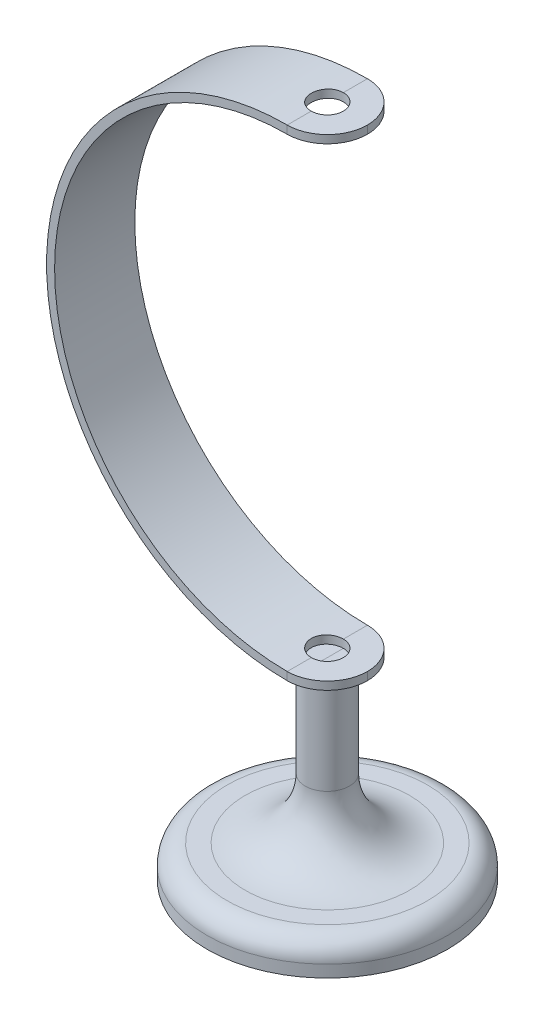
ISO-10303-21;
HEADER;
FILE_DESCRIPTION(('STEP AP214'),'2;1');
FILE_NAME('part.step','',(''),(''),'','','');
FILE_SCHEMA(('AUTOMOTIVE_DESIGN { 1 0 10303 214 1 1 1 1 }'));
ENDSEC;
DATA;
#1=APPLICATION_CONTEXT('core data for automotive mechanical design processes');
#2=APPLICATION_PROTOCOL_DEFINITION('international standard','automotive_design',2000,#1);
#3=PRODUCT_CONTEXT('',#1,'mechanical');
#4=PRODUCT('Part','Part','',(#3));
#5=PRODUCT_RELATED_PRODUCT_CATEGORY('part','',(#4));
#6=PRODUCT_DEFINITION_FORMATION('','',#4);
#7=PRODUCT_DEFINITION_CONTEXT('part definition',#1,'design');
#8=PRODUCT_DEFINITION('design','',#6,#7);
#9=PRODUCT_DEFINITION_SHAPE('','',#8);
#10=(LENGTH_UNIT() NAMED_UNIT(*) SI_UNIT(.MILLI.,.METRE.));
#11=(NAMED_UNIT(*) PLANE_ANGLE_UNIT() SI_UNIT($,.RADIAN.));
#12=(NAMED_UNIT(*) SI_UNIT($,.STERADIAN.) SOLID_ANGLE_UNIT());
#13=UNCERTAINTY_MEASURE_WITH_UNIT(LENGTH_MEASURE(1.E-05),#10,'distance_accuracy_value','');
#14=(GEOMETRIC_REPRESENTATION_CONTEXT(3) GLOBAL_UNCERTAINTY_ASSIGNED_CONTEXT((#13)) GLOBAL_UNIT_ASSIGNED_CONTEXT((#10,
#11,#12)) REPRESENTATION_CONTEXT('',''));
#15=CARTESIAN_POINT('',(0.,0.,0.));
#16=DIRECTION('',(0.,0.,1.));
#17=DIRECTION('',(1.,0.,0.));
#18=AXIS2_PLACEMENT_3D('',#15,#16,#17);
#19=CARTESIAN_POINT('',(0.,0.,10.));
#20=DIRECTION('',(0.,0.,-1.));
#21=DIRECTION('',(-1.,0.,0.));
#22=AXIS2_PLACEMENT_3D('',#19,#20,#21);
#23=CYLINDRICAL_SURFACE('',#22,60.);
#24=DIRECTION('',(0.,0.,-1.));
#25=VECTOR('',#24,1.);
#26=CARTESIAN_POINT('',(0.,60.,10.));
#27=LINE('',#26,#25);
#28=CARTESIAN_POINT('',(0.,60.,10.));
#29=VERTEX_POINT('',#28);
#30=CARTESIAN_POINT('',(0.,60.,4.));
#31=VERTEX_POINT('',#30);
#32=EDGE_CURVE('E178',#29,#31,#27,.T.);
#33=ORIENTED_EDGE('',*,*,#32,.T.);
#34=CARTESIAN_POINT('',(0.,60.,4.));
#35=CARTESIAN_POINT('',(-0.112371032710319,60.0000030634327,4.00001092268718));
#36=CARTESIAN_POINT('',(-0.22473678577279,59.9996843829148,3.99526483089793));
#37=CARTESIAN_POINT('',(-0.448661950342467,59.9984261611816,3.97634317154974));
#38=CARTESIAN_POINT('',(-0.560221406683238,59.9974866547597,3.96216813242241));
#39=CARTESIAN_POINT('',(-0.781663063848554,59.9950103866734,3.92448807132823));
#40=CARTESIAN_POINT('',(-0.891546525483028,59.9934740995825,3.90099046256448));
#41=CARTESIAN_POINT('',(-1.10891204799116,59.989850431352,3.84485781218503));
#42=CARTESIAN_POINT('',(-1.21639413387625,59.9877630559551,3.81222286578685));
#43=CARTESIAN_POINT('',(-1.53419075732481,59.9807549057059,3.70088329524817));
#44=CARTESIAN_POINT('',(-1.739958315075,59.9750868794872,3.60872637429064));
#45=CARTESIAN_POINT('',(-2.1329549311456,59.9623991004775,3.39131240873589));
#46=CARTESIAN_POINT('',(-2.32018700090438,59.9553795678116,3.26606075317259));
#47=CARTESIAN_POINT('',(-2.67127986114069,59.9407640677589,2.98575966756193));
#48=CARTESIAN_POINT('',(-2.83510755957886,59.9331673069989,2.83066875962486));
#49=CARTESIAN_POINT('',(-3.13443791962852,59.9182595797856,2.49516702233937));
#50=CARTESIAN_POINT('',(-3.26993626363705,59.9109486570339,2.31475234045352));
#51=CARTESIAN_POINT('',(-3.50885688423206,59.8974315321756,1.93353713771199));
#52=CARTESIAN_POINT('',(-3.61225029528998,59.8912263263418,1.73271848568472));
#53=CARTESIAN_POINT('',(-3.78383275171654,59.8806316188464,1.31653643347671));
#54=CARTESIAN_POINT('',(-3.85202437272642,59.8762419843479,1.101174098731));
#55=CARTESIAN_POINT('',(-3.95118014022177,59.8697809110163,0.662344951774969));
#56=CARTESIAN_POINT('',(-3.98219930104074,59.867706046695,0.438890621749774));
#57=CARTESIAN_POINT('',(-4.0062993587453,59.8660982411822,-0.0100676249487472));
#58=CARTESIAN_POINT('',(-3.99937980042443,59.8665653304903,-0.235571566181856));
#59=CARTESIAN_POINT('',(-3.94784337127258,59.86998566339,-0.681840002059499));
#60=CARTESIAN_POINT('',(-3.90328719351814,59.8729349042188,-0.902611540818756));
#61=CARTESIAN_POINT('',(-3.77783592004167,59.880980888863,-1.33353418661869));
#62=CARTESIAN_POINT('',(-3.69694074833035,59.886077637169,-1.54368527144966));
#63=CARTESIAN_POINT('',(-3.50103982391652,59.8978489791101,-1.94760041197276));
#64=CARTESIAN_POINT('',(-3.38600588779343,59.9045248754907,-2.14135075743365));
#65=CARTESIAN_POINT('',(-3.12510907508096,59.9187006779185,-2.5068082266178));
#66=CARTESIAN_POINT('',(-2.97924725025485,59.9262005558495,-2.67851610204869));
#67=CARTESIAN_POINT('',(-2.66055291986844,59.9411955701676,-2.99534099193144));
#68=CARTESIAN_POINT('',(-2.48767182301086,59.9486906730973,-3.14040905479783));
#69=CARTESIAN_POINT('',(-2.11980880311531,59.9628230450929,-3.39955441891251));
#70=CARTESIAN_POINT('',(-1.92482001827281,59.9694600464449,-3.51362206069822));
#71=CARTESIAN_POINT('',(-1.62016719837682,59.9782084304312,-3.65893408385144));
#72=CARTESIAN_POINT('',(-1.51649247547567,59.9809252087491,-3.70310035197746));
#73=CARTESIAN_POINT('',(-1.3057891076548,59.9858815616623,-3.78253433606169));
#74=CARTESIAN_POINT('',(-1.1987617446156,59.9881213161534,-3.81780540751401));
#75=CARTESIAN_POINT('',(-0.982232697003488,59.9920573105263,-3.87915913980449));
#76=CARTESIAN_POINT('',(-0.872733845135397,59.9937541418758,-3.90525180282242));
#77=CARTESIAN_POINT('',(-0.65196127842849,59.996559237123,-3.94811083929204));
#78=CARTESIAN_POINT('',(-0.540688458908,59.9976677888072,-3.96488177312304));
#79=CARTESIAN_POINT('',(-0.35764928763552,59.9989764272939,-3.98462412788323));
#80=CARTESIAN_POINT('',(-0.286174065634232,59.9993601371831,-3.99039367817954));
#81=CARTESIAN_POINT('',(-0.143135053144747,59.999871917267,-3.99807887239426));
#82=CARTESIAN_POINT('',(-0.0715716076054835,60.0000004115216,-4.00000090928398));
#83=CARTESIAN_POINT('',(0.,60.,-4.));
#84=B_SPLINE_CURVE_WITH_KNOTS('',3,(#34,#35,#36,#37,#38,#39,#40,#41,#42,#43,#44,#45,#46,#47,#48,
#49,#50,#51,#52,#53,#54,#55,#56,#57,#58,#59,#60,#61,#62,#63,#64,#65,#66,#67,#68,#69,#70,#71,#72,
#73,#74,#75,#76,#77,#78,#79,#80,#81,#82,#83),.UNSPECIFIED.,.F.,.F.,(4,2,2,2,2,2,2,2,2,2,2,2,2,2,
2,2,2,2,2,2,2,2,2,2,4),(0.,0.337002972550628,0.673987059851585,1.01070371653524,
1.34741686452381,2.02053463523423,2.69354286521535,3.36749345524478,4.04154668557006,
4.71620421363562,5.39081237142408,6.06442088769803,6.73803748625929,7.41056987520693,
8.08310367050908,8.75619423115692,9.42926183150128,10.1035541045893,10.7780562410451,
11.1158956626445,11.4536074513665,11.7909500698234,12.1281275078318,12.3431577851045,
12.5578304736941),.UNSPECIFIED.);
#85=CARTESIAN_POINT('',(0.,60.,-4.));
#86=VERTEX_POINT('',#85);
#87=EDGE_CURVE('E220',#31,#86,#84,.T.);
#88=ORIENTED_EDGE('',*,*,#87,.T.);
#89=CARTESIAN_POINT('',(0.,60.,-10.));
#90=VERTEX_POINT('',#89);
#91=EDGE_CURVE('E180',#86,#90,#27,.T.);
#92=ORIENTED_EDGE('',*,*,#91,.T.);
#93=CARTESIAN_POINT('',(0.,0.,-10.));
#94=DIRECTION('',(0.,0.,1.));
#95=DIRECTION('',(1.,0.,0.));
#96=AXIS2_PLACEMENT_3D('',#93,#94,#95);
#97=CIRCLE('',#96,60.);
#98=CARTESIAN_POINT('',(0.,-60.,-10.));
#99=VERTEX_POINT('',#98);
#100=EDGE_CURVE('E185',#90,#99,#97,.T.);
#101=ORIENTED_EDGE('',*,*,#100,.T.);
#102=DIRECTION('',(0.,0.,-1.));
#103=VECTOR('',#102,1.);
#104=CARTESIAN_POINT('',(0.,-60.,10.));
#105=LINE('',#104,#103);
#106=CARTESIAN_POINT('',(0.,-60.,-5.5));
#107=VERTEX_POINT('',#106);
#108=EDGE_CURVE('E159',#107,#99,#105,.T.);
#109=ORIENTED_EDGE('',*,*,#108,.F.);
#110=CARTESIAN_POINT('',(0.,-60.,-4.));
#111=VERTEX_POINT('',#110);
#112=EDGE_CURVE('E139',#111,#107,#105,.T.);
#113=ORIENTED_EDGE('',*,*,#112,.F.);
#114=CARTESIAN_POINT('',(0.,-60.,-4.));
#115=CARTESIAN_POINT('',(-0.112371032710305,-60.0000030634327,-4.00001092268718));
#116=CARTESIAN_POINT('',(-0.224736785772775,-59.9996843829148,-3.99526483089793));
#117=CARTESIAN_POINT('',(-0.448661950342452,-59.9984261611816,-3.97634317154974));
#118=CARTESIAN_POINT('',(-0.560221406683223,-59.9974866547597,-3.96216813242241));
#119=CARTESIAN_POINT('',(-0.78166306384854,-59.9950103866734,-3.92448807132824));
#120=CARTESIAN_POINT('',(-0.891546525483014,-59.9934740995825,-3.90099046256448));
#121=CARTESIAN_POINT('',(-1.10891204799115,-59.989850431352,-3.84485781218504));
#122=CARTESIAN_POINT('',(-1.21639413387624,-59.9877630559551,-3.81222286578686));
#123=CARTESIAN_POINT('',(-1.53419075732479,-59.9807549057059,-3.70088329524817));
#124=CARTESIAN_POINT('',(-1.73995831507498,-59.9750868794872,-3.60872637429064));
#125=CARTESIAN_POINT('',(-2.13295493114558,-59.9623991004775,-3.3913124087359));
#126=CARTESIAN_POINT('',(-2.32018700090436,-59.9553795678116,-3.2660607531726));
#127=CARTESIAN_POINT('',(-2.67127986114068,-59.9407640677589,-2.98575966756194));
#128=CARTESIAN_POINT('',(-2.83510755957885,-59.9331673069989,-2.83066875962487));
#129=CARTESIAN_POINT('',(-3.13443791962851,-59.9182595797856,-2.49516702233939));
#130=CARTESIAN_POINT('',(-3.26993626363704,-59.9109486570339,-2.31475234045353));
#131=CARTESIAN_POINT('',(-3.50885688423206,-59.8974315321756,-1.93353713771201));
#132=CARTESIAN_POINT('',(-3.61225029528997,-59.8912263263418,-1.73271848568474));
#133=CARTESIAN_POINT('',(-3.78383275171654,-59.8806316188464,-1.31653643347672));
#134=CARTESIAN_POINT('',(-3.85202437272642,-59.8762419843479,-1.10117409873101));
#135=CARTESIAN_POINT('',(-3.95118014022177,-59.8697809110163,-0.662344951774984));
#136=CARTESIAN_POINT('',(-3.98219930104073,-59.867706046695,-0.438890621749789));
#137=CARTESIAN_POINT('',(-4.0062993587453,-59.8660982411822,0.0100676249487316));
#138=CARTESIAN_POINT('',(-3.99937980042443,-59.8665653304903,0.235571566181841));
#139=CARTESIAN_POINT('',(-3.94784337127258,-59.86998566339,0.681840002059484));
#140=CARTESIAN_POINT('',(-3.90328719351814,-59.8729349042188,0.902611540818741));
#141=CARTESIAN_POINT('',(-3.77783592004168,-59.880980888863,1.33353418661867));
#142=CARTESIAN_POINT('',(-3.69694074833035,-59.886077637169,1.54368527144965));
#143=CARTESIAN_POINT('',(-3.50103982391652,-59.8978489791101,1.94760041197274));
#144=CARTESIAN_POINT('',(-3.38600588779344,-59.9045248754907,2.14135075743364));
#145=CARTESIAN_POINT('',(-3.12510907508097,-59.9187006779185,2.50680822661779));
#146=CARTESIAN_POINT('',(-2.97924725025486,-59.9262005558495,2.67851610204868));
#147=CARTESIAN_POINT('',(-2.66055291986845,-59.9411955701676,2.99534099193143));
#148=CARTESIAN_POINT('',(-2.48767182301087,-59.9486906730973,3.14040905479782));
#149=CARTESIAN_POINT('',(-2.11980880311532,-59.9628230450929,3.39955441891251));
#150=CARTESIAN_POINT('',(-1.92482001827283,-59.9694600464449,3.51362206069821));
#151=CARTESIAN_POINT('',(-1.62016719837684,-59.9782084304312,3.65893408385143));
#152=CARTESIAN_POINT('',(-1.51649247547568,-59.9809252087491,3.70310035197745));
#153=CARTESIAN_POINT('',(-1.30578910765482,-59.9858815616623,3.78253433606169));
#154=CARTESIAN_POINT('',(-1.19876174461561,-59.9881213161534,3.817805407514));
#155=CARTESIAN_POINT('',(-0.982232697003501,-59.9920573105263,3.87915913980449));
#156=CARTESIAN_POINT('',(-0.872733845135411,-59.9937541418758,3.90525180282242));
#157=CARTESIAN_POINT('',(-0.651961278428503,-59.996559237123,3.94811083929204));
#158=CARTESIAN_POINT('',(-0.540688458908014,-59.9976677888072,3.96488177312304));
#159=CARTESIAN_POINT('',(-0.357649287635531,-59.9989764272939,3.98462412788323));
#160=CARTESIAN_POINT('',(-0.286174065634239,-59.9993601371831,3.99039367817954));
#161=CARTESIAN_POINT('',(-0.143135053144748,-59.999871917267,3.99807887239426));
#162=CARTESIAN_POINT('',(-0.0715716076054825,-60.0000004115216,4.00000090928398));
#163=CARTESIAN_POINT('',(0.,-60.,4.));
#164=B_SPLINE_CURVE_WITH_KNOTS('',3,(#114,#115,#116,#117,#118,#119,#120,#121,#122,#123,#124,
#125,#126,#127,#128,#129,#130,#131,#132,#133,#134,#135,#136,#137,#138,#139,#140,#141,#142,#143,
#144,#145,#146,#147,#148,#149,#150,#151,#152,#153,#154,#155,#156,#157,#158,#159,#160,#161,#162,
#163),.UNSPECIFIED.,.F.,.F.,(4,2,2,2,2,2,2,2,2,2,2,2,2,2,2,2,2,2,2,2,2,2,2,2,4),(0.,
0.337002972550627,0.673987059851585,1.01070371653523,1.34741686452381,2.02053463523423,
2.69354286521535,3.36749345524478,4.04154668557006,4.71620421363562,5.39081237142408,
6.06442088769803,6.73803748625929,7.41056987520693,8.08310367050908,8.75619423115692,
9.42926183150128,10.1035541045893,10.7780562410451,11.1158956626445,11.4536074513665,
11.7909500698234,12.1281275078318,12.3431577851045,12.5578304736941),.UNSPECIFIED.);
#165=CARTESIAN_POINT('',(0.,-60.,4.));
#166=VERTEX_POINT('',#165);
#167=EDGE_CURVE('E150',#111,#166,#164,.T.);
#168=ORIENTED_EDGE('',*,*,#167,.T.);
#169=DIRECTION('',(0.,0.,-1.));
#170=VECTOR('',#169,1.);
#171=CARTESIAN_POINT('',(0.,-60.,10.));
#172=LINE('',#171,#170);
#173=CARTESIAN_POINT('',(0.,-60.,5.5));
#174=VERTEX_POINT('',#173);
#175=EDGE_CURVE('E136',#166,#174,#172,.F.);
#176=ORIENTED_EDGE('',*,*,#175,.T.);
#177=CARTESIAN_POINT('',(0.,-60.,10.));
#178=VERTEX_POINT('',#177);
#179=EDGE_CURVE('E147',#178,#174,#105,.T.);
#180=ORIENTED_EDGE('',*,*,#179,.F.);
#181=CARTESIAN_POINT('',(0.,0.,10.));
#182=DIRECTION('',(0.,0.,1.));
#183=DIRECTION('',(1.,0.,0.));
#184=AXIS2_PLACEMENT_3D('',#181,#182,#183);
#185=CIRCLE('',#184,60.);
#186=EDGE_CURVE('E184',#29,#178,#185,.T.);
#187=ORIENTED_EDGE('',*,*,#186,.F.);
#188=EDGE_LOOP('',(#33,#88,#92,#101,#109,#113,#168,#176,#180,#187));
#189=FACE_BOUND('',#188,.T.);
#190=ADVANCED_FACE('F37',(#189),#23,.T.);
#191=CARTESIAN_POINT('',(0.,-60.,10.));
#192=DIRECTION('',(0.,1.,0.));
#193=DIRECTION('',(0.,0.,1.));
#194=AXIS2_PLACEMENT_3D('',#191,#192,#193);
#195=PLANE('',#194);
#196=ORIENTED_EDGE('',*,*,#179,.T.);
#197=CARTESIAN_POINT('',(0.,-60.,0.));
#198=DIRECTION('',(0.,1.,0.));
#199=DIRECTION('',(0.,0.,1.));
#200=AXIS2_PLACEMENT_3D('',#197,#198,#199);
#201=CIRCLE('',#200,5.5);
#202=EDGE_CURVE('E121',#174,#107,#201,.T.);
#203=ORIENTED_EDGE('',*,*,#202,.T.);
#204=ORIENTED_EDGE('',*,*,#108,.T.);
#205=CARTESIAN_POINT('',(0.,-60.,0.));
#206=DIRECTION('',(0.,1.,0.));
#207=DIRECTION('',(0.,0.,1.));
#208=AXIS2_PLACEMENT_3D('',#205,#206,#207);
#209=CIRCLE('',#208,10.);
#210=CARTESIAN_POINT('',(10.,-60.,0.));
#211=VERTEX_POINT('',#210);
#212=EDGE_CURVE('E493',#99,#211,#209,.F.);
#213=ORIENTED_EDGE('',*,*,#212,.T.);
#214=CARTESIAN_POINT('',(0.,-60.,0.));
#215=DIRECTION('',(0.,1.,0.));
#216=DIRECTION('',(0.,0.,1.));
#217=AXIS2_PLACEMENT_3D('',#214,#215,#216);
#218=CIRCLE('',#217,10.);
#219=EDGE_CURVE('E155',#211,#178,#218,.F.);
#220=ORIENTED_EDGE('',*,*,#219,.T.);
#221=EDGE_LOOP('',(#196,#203,#204,#213,#220));
#222=FACE_BOUND('',#221,.T.);
#223=ADVANCED_FACE('F153',(#222),#195,.F.);
#224=CARTESIAN_POINT('',(0.,-58.,10.));
#225=DIRECTION('',(0.,-1.,0.));
#226=DIRECTION('',(0.,0.,-1.));
#227=AXIS2_PLACEMENT_3D('',#224,#225,#226);
#228=PLANE('',#227);
#229=CARTESIAN_POINT('',(0.,-58.,0.));
#230=DIRECTION('',(0.,-1.,0.));
#231=DIRECTION('',(0.,0.,-1.));
#232=AXIS2_PLACEMENT_3D('',#229,#230,#231);
#233=CIRCLE('',#232,10.);
#234=CARTESIAN_POINT('',(0.,-58.,10.));
#235=VERTEX_POINT('',#234);
#236=CARTESIAN_POINT('',(10.,-58.,0.));
#237=VERTEX_POINT('',#236);
#238=EDGE_CURVE('E161',#235,#237,#233,.F.);
#239=ORIENTED_EDGE('',*,*,#238,.T.);
#240=CARTESIAN_POINT('',(0.,-58.,0.));
#241=DIRECTION('',(0.,-1.,0.));
#242=DIRECTION('',(0.,0.,-1.));
#243=AXIS2_PLACEMENT_3D('',#240,#241,#242);
#244=CIRCLE('',#243,10.);
#245=CARTESIAN_POINT('',(0.,-58.,-10.));
#246=VERTEX_POINT('',#245);
#247=EDGE_CURVE('E492',#237,#246,#244,.F.);
#248=ORIENTED_EDGE('',*,*,#247,.T.);
#249=DIRECTION('',(0.,0.,-1.));
#250=VECTOR('',#249,1.);
#251=CARTESIAN_POINT('',(0.,-58.,10.));
#252=LINE('',#251,#250);
#253=CARTESIAN_POINT('',(0.,-58.,-4.));
#254=VERTEX_POINT('',#253);
#255=EDGE_CURVE('E167',#254,#246,#252,.T.);
#256=ORIENTED_EDGE('',*,*,#255,.F.);
#257=CARTESIAN_POINT('',(0.,-58.,0.));
#258=DIRECTION('',(0.,-1.,0.));
#259=DIRECTION('',(0.,0.,-1.));
#260=AXIS2_PLACEMENT_3D('',#257,#258,#259);
#261=CIRCLE('',#260,4.);
#262=CARTESIAN_POINT('',(0.,-58.,4.));
#263=VERTEX_POINT('',#262);
#264=EDGE_CURVE('E199',#254,#263,#261,.T.);
#265=ORIENTED_EDGE('',*,*,#264,.T.);
#266=EDGE_CURVE('E164',#235,#263,#252,.T.);
#267=ORIENTED_EDGE('',*,*,#266,.F.);
#268=EDGE_LOOP('',(#239,#248,#256,#265,#267));
#269=FACE_BOUND('',#268,.T.);
#270=ADVANCED_FACE('F247',(#269),#228,.F.);
#271=CARTESIAN_POINT('',(0.,0.,10.));
#272=DIRECTION('',(0.,0.,-1.));
#273=DIRECTION('',(-1.,0.,0.));
#274=AXIS2_PLACEMENT_3D('',#271,#272,#273);
#275=CYLINDRICAL_SURFACE('',#274,58.);
#276=DIRECTION('',(0.,0.,-1.));
#277=VECTOR('',#276,1.);
#278=CARTESIAN_POINT('',(0.,58.,10.));
#279=LINE('',#278,#277);
#280=CARTESIAN_POINT('',(0.,58.,-4.));
#281=VERTEX_POINT('',#280);
#282=CARTESIAN_POINT('',(0.,58.,-10.));
#283=VERTEX_POINT('',#282);
#284=EDGE_CURVE('E177',#281,#283,#279,.T.);
#285=ORIENTED_EDGE('',*,*,#284,.F.);
#286=CARTESIAN_POINT('',(0.,58.,-4.));
#287=CARTESIAN_POINT('',(-0.11236175422204,58.0000031682024,-4.00001093280938));
#288=CARTESIAN_POINT('',(-0.224718217128175,57.9996735535033,-3.99526561361154));
#289=CARTESIAN_POINT('',(-0.448624697841071,57.998372159905,-3.97634710411243));
#290=CARTESIAN_POINT('',(-0.560174760939207,57.9974004173586,-3.96217444752137));
#291=CARTESIAN_POINT('',(-0.781596881345706,57.9948391895657,-3.92450095270218));
#292=CARTESIAN_POINT('',(-0.891470209584035,57.993250199101,-3.90100758557461));
#293=CARTESIAN_POINT('',(-1.10881554671644,57.9895022121644,-3.84488531923452));
#294=CARTESIAN_POINT('',(-1.21628758033138,57.9873432215634,-3.8122565141164));
#295=CARTESIAN_POINT('',(-1.53405377947638,57.9800946211758,-3.70093861853809));
#296=CARTESIAN_POINT('',(-1.73980130636269,57.9742321057639,-3.60880037942061));
#297=CARTESIAN_POINT('',(-2.13276194647164,57.9611087272199,-3.39143203312992));
#298=CARTESIAN_POINT('',(-2.31997802722113,57.953848088526,-3.26620723608433));
#299=CARTESIAN_POINT('',(-2.6710629474354,57.9387293705922,-2.98595319092372));
#300=CARTESIAN_POINT('',(-2.83489642905136,57.9308704135565,-2.83087962159238));
#301=CARTESIAN_POINT('',(-3.13424265345783,57.9154475194713,-2.49541164142013));
#302=CARTESIAN_POINT('',(-3.26975107888627,57.9078836275389,-2.31501337753284));
#303=CARTESIAN_POINT('',(-3.50870453840358,57.8938976176425,-1.93381463520119));
#304=CARTESIAN_POINT('',(-3.61211856323652,57.8874766064555,-1.73299467266007));
#305=CARTESIAN_POINT('',(-3.78374068059917,57.8765128985977,-1.31680303303012));
#306=CARTESIAN_POINT('',(-3.85195137186097,57.8719700632837,-1.10143243140634));
#307=CARTESIAN_POINT('',(-3.95113619069501,57.8652833360189,-0.662604025107607));
#308=CARTESIAN_POINT('',(-3.98216923355732,57.8631356488593,-0.439159595509882));
#309=CARTESIAN_POINT('',(-4.00629963168883,57.8614700548312,0.00978191912161445));
#310=CARTESIAN_POINT('',(-3.99939656115485,57.8619521774802,0.235279027166733));
#311=CARTESIAN_POINT('',(-3.9478984256541,57.8654883992797,0.681510227435335));
#312=CARTESIAN_POINT('',(-3.90336830425722,57.8685380668639,0.902251854757237));
#313=CARTESIAN_POINT('',(-3.77798033584864,57.8768587449812,1.33311904716117));
#314=CARTESIAN_POINT('',(-3.6971223996201,57.8821297609697,1.54324458616992));
#315=CARTESIAN_POINT('',(-3.50130137577978,57.8943043483875,1.94712719872821));
#316=CARTESIAN_POINT('',(-3.38630821512077,57.9012093582688,2.14086964461991));
#317=CARTESIAN_POINT('',(-3.12549855944105,57.9158721651976,2.50632010097095));
#318=CARTESIAN_POINT('',(-2.979683083369,57.9236299340498,2.67802883953665));
#319=CARTESIAN_POINT('',(-2.66106195167062,57.9391423245419,2.99488890762832));
#320=CARTESIAN_POINT('',(-2.48820403312607,57.9468969103096,3.13998760504947));
#321=CARTESIAN_POINT('',(-2.12038007456978,57.9615193174616,3.39919831369613));
#322=CARTESIAN_POINT('',(-1.92540718047545,57.9683868625078,3.51330068084253));
#323=CARTESIAN_POINT('',(-1.62077081854989,57.9774398343909,3.65866683906783));
#324=CARTESIAN_POINT('',(-1.51710007660152,57.980251340629,3.70285158867142));
#325=CARTESIAN_POINT('',(-1.30640229889772,57.9853807852697,3.78232271476375));
#326=CARTESIAN_POINT('',(-1.19937654633164,57.9876989097959,3.81761244774321));
#327=CARTESIAN_POINT('',(-0.98284831729815,57.9917729578114,3.87900334373393));
#328=CARTESIAN_POINT('',(-0.873348674526821,57.9935294927661,3.90511450358788));
#329=CARTESIAN_POINT('',(-0.652572389128576,57.9964337149082,3.94801002846066));
#330=CARTESIAN_POINT('',(-0.541296642615294,57.9975816997169,3.96479895286167));
#331=CARTESIAN_POINT('',(-0.358154011001368,57.9989381388956,3.98458061678791));
#332=CARTESIAN_POINT('',(-0.28657828447771,57.9993362007817,3.99036648869507));
#333=CARTESIAN_POINT('',(-0.143337530879748,57.9998671256579,3.99807343424415));
#334=CARTESIAN_POINT('',(-0.071672850458434,58.0000004287328,4.0000009213766));
#335=CARTESIAN_POINT('',(0.,58.,4.));
#336=B_SPLINE_CURVE_WITH_KNOTS('',3,(#286,#287,#288,#289,#290,#291,#292,#293,#294,#295,#296,
#297,#298,#299,#300,#301,#302,#303,#304,#305,#306,#307,#308,#309,#310,#311,#312,#313,#314,#315,
#316,#317,#318,#319,#320,#321,#322,#323,#324,#325,#326,#327,#328,#329,#330,#331,#332,#333,#334,
#335),.UNSPECIFIED.,.F.,.F.,(4,2,2,2,2,2,2,2,2,2,2,2,2,2,2,2,2,2,2,2,2,2,2,2,4),(0.,
0.33697511168641,0.673931147811789,1.01061763767491,1.34730065981684,2.02035634855754,
2.69330408279457,3.36725886725825,4.04131630248043,4.71602299146935,5.39067986606235,
6.06426619401801,6.73786008246846,7.4102937299492,8.08272902885723,8.75575850872605,
9.42876574252874,10.1030900919431,10.7776240083681,11.1154810495627,11.4532104105617,
11.790570785543,12.1277660163597,12.3431005323963,12.5580768165367),.UNSPECIFIED.);
#337=CARTESIAN_POINT('',(0.,58.,4.));
#338=VERTEX_POINT('',#337);
#339=EDGE_CURVE('E230',#281,#338,#336,.T.);
#340=ORIENTED_EDGE('',*,*,#339,.T.);
#341=CARTESIAN_POINT('',(0.,58.,10.));
#342=VERTEX_POINT('',#341);
#343=EDGE_CURVE('E173',#342,#338,#279,.T.);
#344=ORIENTED_EDGE('',*,*,#343,.F.);
#345=CARTESIAN_POINT('',(0.,0.,10.));
#346=DIRECTION('',(0.,0.,-1.));
#347=DIRECTION('',(1.,0.,0.));
#348=AXIS2_PLACEMENT_3D('',#345,#346,#347);
#349=CIRCLE('',#348,58.);
#350=EDGE_CURVE('E188',#235,#342,#349,.T.);
#351=ORIENTED_EDGE('',*,*,#350,.F.);
#352=ORIENTED_EDGE('',*,*,#266,.T.);
#353=CARTESIAN_POINT('',(0.,-58.,4.));
#354=CARTESIAN_POINT('',(-0.112361754222025,-58.0000031682024,4.00001093280938));
#355=CARTESIAN_POINT('',(-0.224718217128161,-57.9996735535033,3.99526561361154));
#356=CARTESIAN_POINT('',(-0.448624697841058,-57.998372159905,3.97634710411243));
#357=CARTESIAN_POINT('',(-0.560174760939194,-57.9974004173586,3.96217444752137));
#358=CARTESIAN_POINT('',(-0.781596881345693,-57.9948391895657,3.92450095270218));
#359=CARTESIAN_POINT('',(-0.891470209584021,-57.993250199101,3.90100758557461));
#360=CARTESIAN_POINT('',(-1.10881554671643,-57.9895022121644,3.84488531923452));
#361=CARTESIAN_POINT('',(-1.21628758033137,-57.9873432215634,3.81225651411641));
#362=CARTESIAN_POINT('',(-1.53405377947636,-57.9800946211758,3.7009386185381));
#363=CARTESIAN_POINT('',(-1.73980130636268,-57.9742321057639,3.60880037942061));
#364=CARTESIAN_POINT('',(-2.13276194647163,-57.9611087272199,3.39143203312993));
#365=CARTESIAN_POINT('',(-2.31997802722112,-57.953848088526,3.26620723608434));
#366=CARTESIAN_POINT('',(-2.67106294743539,-57.9387293705922,2.98595319092372));
#367=CARTESIAN_POINT('',(-2.83489642905135,-57.9308704135565,2.83087962159239));
#368=CARTESIAN_POINT('',(-3.13424265345782,-57.9154475194713,2.49541164142014));
#369=CARTESIAN_POINT('',(-3.26975107888626,-57.9078836275389,2.31501337753285));
#370=CARTESIAN_POINT('',(-3.50870453840358,-57.8938976176425,1.9338146352012));
#371=CARTESIAN_POINT('',(-3.61211856323651,-57.8874766064555,1.73299467266008));
#372=CARTESIAN_POINT('',(-3.78374068059917,-57.8765128985977,1.31680303303014));
#373=CARTESIAN_POINT('',(-3.85195137186096,-57.8719700632837,1.10143243140635));
#374=CARTESIAN_POINT('',(-3.95113619069501,-57.8652833360189,0.662604025107619));
#375=CARTESIAN_POINT('',(-3.98216923355732,-57.8631356488593,0.439159595509894));
#376=CARTESIAN_POINT('',(-4.00629963168883,-57.8614700548312,-0.00978191912160201));
#377=CARTESIAN_POINT('',(-3.99939656115485,-57.8619521774802,-0.235279027166721));
#378=CARTESIAN_POINT('',(-3.9478984256541,-57.8654883992797,-0.681510227435322));
#379=CARTESIAN_POINT('',(-3.90336830425722,-57.8685380668639,-0.902251854757224));
#380=CARTESIAN_POINT('',(-3.77798033584865,-57.8768587449812,-1.33311904716116));
#381=CARTESIAN_POINT('',(-3.6971223996201,-57.8821297609697,-1.54324458616991));
#382=CARTESIAN_POINT('',(-3.50130137577978,-57.8943043483875,-1.9471271987282));
#383=CARTESIAN_POINT('',(-3.38630821512078,-57.9012093582688,-2.1408696446199));
#384=CARTESIAN_POINT('',(-3.12549855944106,-57.9158721651976,-2.50632010097094));
#385=CARTESIAN_POINT('',(-2.97968308336901,-57.9236299340498,-2.67802883953664));
#386=CARTESIAN_POINT('',(-2.66106195167063,-57.9391423245419,-2.99488890762831));
#387=CARTESIAN_POINT('',(-2.48820403312608,-57.9468969103096,-3.13998760504946));
#388=CARTESIAN_POINT('',(-2.12038007456979,-57.9615193174616,-3.39919831369612));
#389=CARTESIAN_POINT('',(-1.92540718047546,-57.9683868625078,-3.51330068084252));
#390=CARTESIAN_POINT('',(-1.6207708185499,-57.9774398343909,-3.65866683906783));
#391=CARTESIAN_POINT('',(-1.51710007660153,-57.980251340629,-3.70285158867142));
#392=CARTESIAN_POINT('',(-1.30640229889773,-57.9853807852697,-3.78232271476375));
#393=CARTESIAN_POINT('',(-1.19937654633165,-57.9876989097959,-3.81761244774321));
#394=CARTESIAN_POINT('',(-0.982848317298161,-57.9917729578114,-3.87900334373392));
#395=CARTESIAN_POINT('',(-0.873348674526833,-57.9935294927661,-3.90511450358788));
#396=CARTESIAN_POINT('',(-0.652572389128587,-57.9964337149082,-3.94801002846066));
#397=CARTESIAN_POINT('',(-0.541296642615306,-57.9975816997169,-3.96479895286167));
#398=CARTESIAN_POINT('',(-0.358154011001376,-57.9989381388956,-3.98458061678791));
#399=CARTESIAN_POINT('',(-0.286578284477714,-57.9993362007817,-3.99036648869507));
#400=CARTESIAN_POINT('',(-0.143337530879743,-57.9998671256579,-3.99807343424415));
#401=CARTESIAN_POINT('',(-0.0716728504584244,-58.0000004287328,-4.0000009213766));
#402=CARTESIAN_POINT('',(0.,-58.,-4.));
#403=B_SPLINE_CURVE_WITH_KNOTS('',3,(#353,#354,#355,#356,#357,#358,#359,#360,#361,#362,#363,
#364,#365,#366,#367,#368,#369,#370,#371,#372,#373,#374,#375,#376,#377,#378,#379,#380,#381,#382,
#383,#384,#385,#386,#387,#388,#389,#390,#391,#392,#393,#394,#395,#396,#397,#398,#399,#400,#401,
#402),.UNSPECIFIED.,.F.,.F.,(4,2,2,2,2,2,2,2,2,2,2,2,2,2,2,2,2,2,2,2,2,2,2,2,4),(0.,
0.336975111686411,0.673931147811789,1.01061763767491,1.34730065981684,2.02035634855754,
2.69330408279457,3.36725886725825,4.04131630248043,4.71602299146935,5.39067986606235,
6.06426619401801,6.73786008246846,7.4102937299492,8.08272902885723,8.75575850872605,
9.42876574252874,10.1030900919431,10.7776240083681,11.1154810495627,11.4532104105617,
11.790570785543,12.1277660163597,12.3431005323963,12.5580768165367),.UNSPECIFIED.);
#404=EDGE_CURVE('E236',#263,#254,#403,.T.);
#405=ORIENTED_EDGE('',*,*,#404,.T.);
#406=ORIENTED_EDGE('',*,*,#255,.T.);
#407=CARTESIAN_POINT('',(0.,0.,-10.));
#408=DIRECTION('',(0.,0.,-1.));
#409=DIRECTION('',(1.,0.,0.));
#410=AXIS2_PLACEMENT_3D('',#407,#408,#409);
#411=CIRCLE('',#410,58.);
#412=EDGE_CURVE('E181',#246,#283,#411,.T.);
#413=ORIENTED_EDGE('',*,*,#412,.T.);
#414=EDGE_LOOP('',(#285,#340,#344,#351,#352,#405,#406,#413));
#415=FACE_BOUND('',#414,.T.);
#416=ADVANCED_FACE('F241',(#415),#275,.F.);
#417=CARTESIAN_POINT('',(0.,58.,10.));
#418=DIRECTION('',(0.,1.,0.));
#419=DIRECTION('',(0.,0.,1.));
#420=AXIS2_PLACEMENT_3D('',#417,#418,#419);
#421=PLANE('',#420);
#422=ORIENTED_EDGE('',*,*,#284,.T.);
#423=CARTESIAN_POINT('',(0.,58.,0.));
#424=DIRECTION('',(0.,1.,0.));
#425=DIRECTION('',(0.,0.,1.));
#426=AXIS2_PLACEMENT_3D('',#423,#424,#425);
#427=CIRCLE('',#426,10.);
#428=CARTESIAN_POINT('',(10.,58.,0.));
#429=VERTEX_POINT('',#428);
#430=EDGE_CURVE('E52',#283,#429,#427,.F.);
#431=ORIENTED_EDGE('',*,*,#430,.T.);
#432=CARTESIAN_POINT('',(0.,58.,0.));
#433=DIRECTION('',(0.,1.,0.));
#434=DIRECTION('',(0.,0.,1.));
#435=AXIS2_PLACEMENT_3D('',#432,#433,#434);
#436=CIRCLE('',#435,10.);
#437=EDGE_CURVE('E507',#429,#342,#436,.F.);
#438=ORIENTED_EDGE('',*,*,#437,.T.);
#439=ORIENTED_EDGE('',*,*,#343,.T.);
#440=CARTESIAN_POINT('',(0.,58.,0.));
#441=DIRECTION('',(0.,1.,0.));
#442=DIRECTION('',(0.,0.,1.));
#443=AXIS2_PLACEMENT_3D('',#440,#441,#442);
#444=CIRCLE('',#443,4.);
#445=EDGE_CURVE('E479',#338,#281,#444,.T.);
#446=ORIENTED_EDGE('',*,*,#445,.T.);
#447=EDGE_LOOP('',(#422,#431,#438,#439,#446));
#448=FACE_BOUND('',#447,.T.);
#449=ADVANCED_FACE('F246',(#448),#421,.F.);
#450=CARTESIAN_POINT('',(0.,60.,10.));
#451=DIRECTION('',(0.,-1.,0.));
#452=DIRECTION('',(0.,0.,-1.));
#453=AXIS2_PLACEMENT_3D('',#450,#451,#452);
#454=PLANE('',#453);
#455=CARTESIAN_POINT('',(0.,60.,0.));
#456=DIRECTION('',(0.,-1.,0.));
#457=DIRECTION('',(0.,0.,-1.));
#458=AXIS2_PLACEMENT_3D('',#455,#456,#457);
#459=CIRCLE('',#458,10.);
#460=CARTESIAN_POINT('',(10.,60.,0.));
#461=VERTEX_POINT('',#460);
#462=EDGE_CURVE('E60',#29,#461,#459,.F.);
#463=ORIENTED_EDGE('',*,*,#462,.T.);
#464=CARTESIAN_POINT('',(0.,60.,0.));
#465=DIRECTION('',(0.,-1.,0.));
#466=DIRECTION('',(0.,0.,-1.));
#467=AXIS2_PLACEMENT_3D('',#464,#465,#466);
#468=CIRCLE('',#467,10.);
#469=EDGE_CURVE('E505',#461,#90,#468,.F.);
#470=ORIENTED_EDGE('',*,*,#469,.T.);
#471=ORIENTED_EDGE('',*,*,#91,.F.);
#472=CARTESIAN_POINT('',(0.,60.,0.));
#473=DIRECTION('',(0.,-1.,0.));
#474=DIRECTION('',(0.,0.,-1.));
#475=AXIS2_PLACEMENT_3D('',#472,#473,#474);
#476=CIRCLE('',#475,4.);
#477=EDGE_CURVE('E157',#86,#31,#476,.T.);
#478=ORIENTED_EDGE('',*,*,#477,.T.);
#479=ORIENTED_EDGE('',*,*,#32,.F.);
#480=EDGE_LOOP('',(#463,#470,#471,#478,#479));
#481=FACE_BOUND('',#480,.T.);
#482=ADVANCED_FACE('F425',(#481),#454,.F.);
#483=CARTESIAN_POINT('',(0.,0.,10.));
#484=DIRECTION('',(0.,0.,1.));
#485=DIRECTION('',(1.,0.,0.));
#486=AXIS2_PLACEMENT_3D('',#483,#484,#485);
#487=PLANE('',#486);
#488=ORIENTED_EDGE('',*,*,#186,.T.);
#489=DIRECTION('',(0.,1.,0.));
#490=VECTOR('',#489,1.);
#491=CARTESIAN_POINT('',(0.,-58.,10.));
#492=LINE('',#491,#490);
#493=EDGE_CURVE('E502',#178,#235,#492,.T.);
#494=ORIENTED_EDGE('',*,*,#493,.T.);
#495=ORIENTED_EDGE('',*,*,#350,.T.);
#496=DIRECTION('',(0.,1.,0.));
#497=VECTOR('',#496,1.);
#498=CARTESIAN_POINT('',(0.,60.,10.));
#499=LINE('',#498,#497);
#500=EDGE_CURVE('E500',#342,#29,#499,.T.);
#501=ORIENTED_EDGE('',*,*,#500,.T.);
#502=EDGE_LOOP('',(#488,#494,#495,#501));
#503=FACE_BOUND('',#502,.T.);
#504=ADVANCED_FACE('F215',(#503),#487,.T.);
#505=CARTESIAN_POINT('',(0.,0.,-10.));
#506=DIRECTION('',(0.,0.,1.));
#507=DIRECTION('',(1.,0.,0.));
#508=AXIS2_PLACEMENT_3D('',#505,#506,#507);
#509=PLANE('',#508);
#510=ORIENTED_EDGE('',*,*,#412,.F.);
#511=DIRECTION('',(0.,1.,0.));
#512=VECTOR('',#511,1.);
#513=CARTESIAN_POINT('',(0.,0.,-10.));
#514=LINE('',#513,#512);
#515=EDGE_CURVE('E487',#246,#99,#514,.F.);
#516=ORIENTED_EDGE('',*,*,#515,.T.);
#517=ORIENTED_EDGE('',*,*,#100,.F.);
#518=DIRECTION('',(0.,1.,0.));
#519=VECTOR('',#518,1.);
#520=CARTESIAN_POINT('',(0.,0.,-10.));
#521=LINE('',#520,#519);
#522=EDGE_CURVE('E489',#90,#283,#521,.F.);
#523=ORIENTED_EDGE('',*,*,#522,.T.);
#524=EDGE_LOOP('',(#510,#516,#517,#523));
#525=FACE_BOUND('',#524,.T.);
#526=ADVANCED_FACE('F408',(#525),#509,.F.);
#527=CARTESIAN_POINT('',(0.,-60.,0.));
#528=DIRECTION('',(0.,1.,0.));
#529=DIRECTION('',(0.,0.,1.));
#530=AXIS2_PLACEMENT_3D('',#527,#528,#529);
#531=CYLINDRICAL_SURFACE('',#530,4.);
#532=ORIENTED_EDGE('',*,*,#477,.F.);
#533=ORIENTED_EDGE('',*,*,#87,.F.);
#534=EDGE_LOOP('',(#532,#533));
#535=FACE_BOUND('',#534,.T.);
#536=ORIENTED_EDGE('',*,*,#445,.F.);
#537=ORIENTED_EDGE('',*,*,#339,.F.);
#538=EDGE_LOOP('',(#536,#537));
#539=FACE_BOUND('',#538,.T.);
#540=ADVANCED_FACE('F210',(#535,#539),#531,.F.);
#541=ORIENTED_EDGE('',*,*,#404,.F.);
#542=ORIENTED_EDGE('',*,*,#264,.F.);
#543=EDGE_LOOP('',(#541,#542));
#544=FACE_BOUND('',#543,.T.);
#545=ORIENTED_EDGE('',*,*,#167,.F.);
#546=CARTESIAN_POINT('',(0.,-60.,4.));
#547=CARTESIAN_POINT('',(-0.2244143632165,-59.9999982319385,3.99999013780706));
#548=CARTESIAN_POINT('',(-0.448985088190979,-59.9987274976207,3.9810508494827));
#549=CARTESIAN_POINT('',(-0.891923413843711,-59.99378045484,3.90577136106175));
#550=CARTESIAN_POINT('',(-1.11028352272832,-59.9901013597696,3.84938783479889));
#551=CARTESIAN_POINT('',(-1.53432066943878,-59.9807537204208,3.70084849951565));
#552=CARTESIAN_POINT('',(-1.74000441612869,-59.9750862392966,3.60871180428332));
#553=CARTESIAN_POINT('',(-2.13293386113196,-59.962398931422,3.39131313131516));
#554=CARTESIAN_POINT('',(-2.32018371939413,-59.9553794108463,3.26605865084632));
#555=CARTESIAN_POINT('',(-2.67129839783537,-59.940763590109,2.98574959766924));
#556=CARTESIAN_POINT('',(-2.83512802671435,-59.9331664477113,2.83065098462584));
#557=CARTESIAN_POINT('',(-3.13445053751007,-59.9182587913309,2.49514771282138));
#558=CARTESIAN_POINT('',(-3.26994222490441,-59.9109482894414,2.31474198783107));
#559=CARTESIAN_POINT('',(-3.50885384130679,-59.8974317346885,1.93354283468223));
#560=CARTESIAN_POINT('',(-3.61224411730551,-59.8912267052233,1.73273078248269));
#561=CARTESIAN_POINT('',(-3.7838283895664,-59.8806318907438,1.31654970201288));
#562=CARTESIAN_POINT('',(-3.85202280717888,-59.8762420839986,1.10118084804554));
#563=CARTESIAN_POINT('',(-3.95118079757155,-59.869780870541,0.662342221560849));
#564=CARTESIAN_POINT('',(-3.98220006571024,-59.8677059959483,0.438885085598605));
#565=CARTESIAN_POINT('',(-4.00629919003214,-59.8660982521771,-0.0100731909045589));
#566=CARTESIAN_POINT('',(-3.99937952583034,-59.8665653508637,-0.235574305570007));
#567=CARTESIAN_POINT('',(-3.94784338709098,-59.8699856601942,-0.681839504061157));
#568=CARTESIAN_POINT('',(-3.90328722697835,-59.8729348930626,-0.902610587917283));
#569=CARTESIAN_POINT('',(-3.7778364623654,-59.8809808631299,-1.3335331617139));
#570=CARTESIAN_POINT('',(-3.69694161568835,-59.8860776146409,-1.54368458086996));
#571=CARTESIAN_POINT('',(-3.50104148044305,-59.8978488499587,-1.9475958978416));
#572=CARTESIAN_POINT('',(-3.38600888469752,-59.9045245959502,-2.14134251318975));
#573=CARTESIAN_POINT('',(-3.12511837169288,-59.9187002892829,-2.50679925004487));
#574=CARTESIAN_POINT('',(-2.9792600585898,-59.9262002472075,-2.67850908852427));
#575=CARTESIAN_POINT('',(-2.66051904333115,-59.9411968695241,-2.99536893891027));
#576=CARTESIAN_POINT('',(-2.48758415279324,-59.9486934989193,-3.14046645944789));
#577=CARTESIAN_POINT('',(-2.11978176662741,-59.9628246271918,-3.39957782821268));
#578=CARTESIAN_POINT('',(-1.92491426230712,-59.9694591257274,-3.51359166412066));
#579=CARTESIAN_POINT('',(-1.51874597893531,-59.9811190476907,-3.7072949949371));
#580=CARTESIAN_POINT('',(-1.30744422036319,-59.9861443751165,-3.78698244205751));
#581=CARTESIAN_POINT('',(-0.8744199843212,-59.9940184377385,-3.90973559827357));
#582=CARTESIAN_POINT('',(-0.652697645326817,-59.9968672018498,-3.95280179387118));
#583=CARTESIAN_POINT('',(-0.205581484498404,-60.0000634137438,-4.00102477702632));
#584=CARTESIAN_POINT('',(0.0198044785873775,-60.0004156492262,-4.00625412632292));
#585=CARTESIAN_POINT('',(0.468250286702399,-59.9985918572791,-3.97884465491226));
#586=CARTESIAN_POINT('',(0.691310145521959,-59.996415844847,-3.94620605883421));
#587=CARTESIAN_POINT('',(1.12856704211748,-59.9897835574557,-3.84404727858083));
#588=CARTESIAN_POINT('',(1.34277190603583,-59.9853293446711,-3.77456044648957));
#589=CARTESIAN_POINT('',(1.75648003205678,-59.9746416349699,-3.60071157725684));
#590=CARTESIAN_POINT('',(1.95598314389142,-59.9684081198703,-3.49634918370939));
#591=CARTESIAN_POINT('',(2.33495652553314,-59.954849995477,-3.25552736055646));
#592=CARTESIAN_POINT('',(2.51439598405399,-59.9475237472946,-3.11901953789259));
#593=CARTESIAN_POINT('',(2.84783811058594,-59.9326099094019,-2.81785215638414));
#594=CARTESIAN_POINT('',(3.0018404944818,-59.9250223167736,-2.65319228314164));
#595=CARTESIAN_POINT('',(3.28028326193798,-59.9104270350126,-2.30008150615973));
#596=CARTESIAN_POINT('',(3.40467652142647,-59.9034202817053,-2.11159339913097));
#597=CARTESIAN_POINT('',(3.62004749642952,-59.8907918177568,-1.71636329772055));
#598=CARTESIAN_POINT('',(3.71102544094887,-59.8851700976238,-1.50962142844924));
#599=CARTESIAN_POINT('',(3.85690188691157,-59.875952458493,-1.083923634803));
#600=CARTESIAN_POINT('',(3.91182990365935,-59.8723548826047,-0.864977861939046));
#601=CARTESIAN_POINT('',(3.98414363280009,-59.8675866657196,-0.420946673780025));
#602=CARTESIAN_POINT('',(4.00152977912161,-59.8664159966713,-0.195861329479781));
#603=CARTESIAN_POINT('',(3.99826193413915,-59.8666342966914,0.253591158544595));
#604=CARTESIAN_POINT('',(3.97768201855636,-59.8680182813685,0.477958847025796));
#605=CARTESIAN_POINT('',(3.89921997704723,-59.8731793701588,0.920045069870533));
#606=CARTESIAN_POINT('',(3.84133778512083,-59.8769564785062,1.13776359246878));
#607=CARTESIAN_POINT('',(3.68993135113136,-59.8864769442146,1.56038117705586));
#608=CARTESIAN_POINT('',(3.59640761867671,-59.8922202734621,1.76528042228799));
#609=CARTESIAN_POINT('',(3.37638258950109,-59.9050259252621,2.156478967674));
#610=CARTESIAN_POINT('',(3.24988208696115,-59.9120882160488,2.34277871561101));
#611=CARTESIAN_POINT('',(2.96721909977452,-59.9267521183552,2.69186655599824));
#612=CARTESIAN_POINT('',(2.811002698332,-59.9343546942185,2.8546109493276));
#613=CARTESIAN_POINT('',(2.47342170621884,-59.9492340854126,3.15162403706884));
#614=CARTESIAN_POINT('',(2.29205098445322,-59.9565108207495,3.28588576889505));
#615=CARTESIAN_POINT('',(1.90907839535557,-59.9699270982247,3.52223527018335));
#616=CARTESIAN_POINT('',(1.70744963188205,-59.976065096892,3.6242795007754));
#617=CARTESIAN_POINT('',(1.29002486167742,-59.9864921745022,3.79294011692656));
#618=CARTESIAN_POINT('',(1.07424572553379,-59.9907834106478,3.85959785881431));
#619=CARTESIAN_POINT('',(0.714295495088454,-59.9959129511077,3.93832995835281));
#620=CARTESIAN_POINT('',(0.572449136647912,-59.9974387538266,3.96142617327001));
#621=CARTESIAN_POINT('',(0.287089851278627,-59.9994828430588,3.99226433669041));
#622=CARTESIAN_POINT('',(0.14357692700829,-60.0000011311791,4.00000630968239));
#623=CARTESIAN_POINT('',(0.,-60.,4.));
#624=B_SPLINE_CURVE_WITH_KNOTS('',3,(#546,#547,#548,#549,#550,#551,#552,#553,#554,#555,#556,
#557,#558,#559,#560,#561,#562,#563,#564,#565,#566,#567,#568,#569,#570,#571,#572,#573,#574,#575,
#576,#577,#578,#579,#580,#581,#582,#583,#584,#585,#586,#587,#588,#589,#590,#591,#592,#593,#594,
#595,#596,#597,#598,#599,#600,#601,#602,#603,#604,#605,#606,#607,#608,#609,#610,#611,#612,#613,
#614,#615,#616,#617,#618,#619,#620,#621,#622,#623),.UNSPECIFIED.,.T.,.F.,(4,2,2,2,2,2,2,2,2,2,2,
2,2,2,2,2,2,2,2,2,2,2,2,2,2,2,2,2,2,2,2,2,2,2,2,2,2,2,4),(0.,0.672718936177167,1.34621762473785,
2.01935675313299,2.69234362529585,3.36633133314894,4.04034744571976,4.71498432692662,
5.38961313147124,6.06322994673564,6.73683824631572,7.40936909739253,8.08190443057258,
8.75497918923633,9.42806259161694,10.102459662983,10.7768570016278,11.4512945668056,
12.1257231721496,12.7988580461185,13.4719889271327,14.1445115810793,14.8170411079887,
15.4905896352959,16.1641456851846,16.8387666632978,17.5133830179522,18.1874463498937,
18.8615018906173,19.5342436698264,20.2069866393413,20.879719990231,21.5524371411496,
22.2263867239113,22.9005008642727,23.5755221441446,24.2497527774861,24.6801488994674,
25.1105443350012),.UNSPECIFIED.);
#625=EDGE_CURVE('E129',#111,#166,#624,.T.);
#626=ORIENTED_EDGE('',*,*,#625,.T.);
#627=EDGE_LOOP('',(#545,#626));
#628=FACE_BOUND('',#627,.T.);
#629=ADVANCED_FACE('F204',(#544,#628),#531,.F.);
#630=CARTESIAN_POINT('',(0.,0.,0.));
#631=DIRECTION('',(0.,-1.,0.));
#632=DIRECTION('',(0.,0.,-1.));
#633=AXIS2_PLACEMENT_3D('',#630,#631,#632);
#634=CYLINDRICAL_SURFACE('',#633,10.);
#635=ORIENTED_EDGE('',*,*,#493,.F.);
#636=ORIENTED_EDGE('',*,*,#219,.F.);
#637=DIRECTION('',(0.,1.,0.));
#638=VECTOR('',#637,1.);
#639=CARTESIAN_POINT('',(10.,-60.,0.));
#640=LINE('',#639,#638);
#641=EDGE_CURVE('E510',#237,#211,#640,.F.);
#642=ORIENTED_EDGE('',*,*,#641,.F.);
#643=ORIENTED_EDGE('',*,*,#238,.F.);
#644=EDGE_LOOP('',(#635,#636,#642,#643));
#645=FACE_BOUND('',#644,.T.);
#646=ADVANCED_FACE('F209',(#645),#634,.T.);
#647=CARTESIAN_POINT('',(0.,-58.,0.));
#648=DIRECTION('',(0.,1.,0.));
#649=DIRECTION('',(0.,0.,1.));
#650=AXIS2_PLACEMENT_3D('',#647,#648,#649);
#651=CYLINDRICAL_SURFACE('',#650,10.);
#652=ORIENTED_EDGE('',*,*,#212,.F.);
#653=ORIENTED_EDGE('',*,*,#515,.F.);
#654=ORIENTED_EDGE('',*,*,#247,.F.);
#655=ORIENTED_EDGE('',*,*,#641,.T.);
#656=EDGE_LOOP('',(#652,#653,#654,#655));
#657=FACE_BOUND('',#656,.T.);
#658=ADVANCED_FACE('F385',(#657),#651,.T.);
#659=CARTESIAN_POINT('',(0.,0.,0.));
#660=DIRECTION('',(0.,-1.,0.));
#661=DIRECTION('',(0.,0.,-1.));
#662=AXIS2_PLACEMENT_3D('',#659,#660,#661);
#663=CYLINDRICAL_SURFACE('',#662,10.);
#664=ORIENTED_EDGE('',*,*,#500,.F.);
#665=ORIENTED_EDGE('',*,*,#437,.F.);
#666=DIRECTION('',(0.,1.,0.));
#667=VECTOR('',#666,1.);
#668=CARTESIAN_POINT('',(10.,58.,0.));
#669=LINE('',#668,#667);
#670=EDGE_CURVE('E512',#461,#429,#669,.F.);
#671=ORIENTED_EDGE('',*,*,#670,.F.);
#672=ORIENTED_EDGE('',*,*,#462,.F.);
#673=EDGE_LOOP('',(#664,#665,#671,#672));
#674=FACE_BOUND('',#673,.T.);
#675=ADVANCED_FACE('F376',(#674),#663,.T.);
#676=CARTESIAN_POINT('',(0.,60.,0.));
#677=DIRECTION('',(0.,1.,0.));
#678=DIRECTION('',(0.,0.,1.));
#679=AXIS2_PLACEMENT_3D('',#676,#677,#678);
#680=CYLINDRICAL_SURFACE('',#679,10.);
#681=ORIENTED_EDGE('',*,*,#430,.F.);
#682=ORIENTED_EDGE('',*,*,#522,.F.);
#683=ORIENTED_EDGE('',*,*,#469,.F.);
#684=ORIENTED_EDGE('',*,*,#670,.T.);
#685=EDGE_LOOP('',(#681,#682,#683,#684));
#686=FACE_BOUND('',#685,.T.);
#687=ADVANCED_FACE('F265',(#686),#680,.T.);
#688=CARTESIAN_POINT('',(0.,60.001,0.));
#689=DIRECTION('',(0.,-1.,0.));
#690=DIRECTION('',(0.,0.,-1.));
#691=AXIS2_PLACEMENT_3D('',#688,#689,#690);
#692=CYLINDRICAL_SURFACE('',#691,5.5);
#693=CARTESIAN_POINT('',(0.,-85.,0.));
#694=DIRECTION('',(0.,-1.,0.));
#695=DIRECTION('',(0.,0.,-1.));
#696=AXIS2_PLACEMENT_3D('',#693,#694,#695);
#697=CIRCLE('',#696,5.5);
#698=CARTESIAN_POINT('',(0.,-85.,-5.5));
#699=VERTEX_POINT('',#698);
#700=EDGE_CURVE('E520',#699,#699,#697,.F.);
#701=ORIENTED_EDGE('',*,*,#700,.T.);
#702=EDGE_LOOP('',(#701));
#703=FACE_BOUND('',#702,.T.);
#704=ORIENTED_EDGE('',*,*,#202,.F.);
#705=CARTESIAN_POINT('',(0.,-60.,0.));
#706=DIRECTION('',(0.,-1.,0.));
#707=DIRECTION('',(0.,0.,-1.));
#708=AXIS2_PLACEMENT_3D('',#705,#706,#707);
#709=CIRCLE('',#708,5.5);
#710=EDGE_CURVE('E124',#174,#107,#709,.T.);
#711=ORIENTED_EDGE('',*,*,#710,.T.);
#712=EDGE_LOOP('',(#704,#711));
#713=FACE_BOUND('',#712,.T.);
#714=ADVANCED_FACE('F123',(#703,#713),#692,.T.);
#715=CARTESIAN_POINT('',(0.,0.,10.));
#716=DIRECTION('',(0.,0.,-1.));
#717=DIRECTION('',(-1.,0.,0.));
#718=AXIS2_PLACEMENT_3D('',#715,#716,#717);
#719=CYLINDRICAL_SURFACE('',#718,60.);
#720=ORIENTED_EDGE('',*,*,#625,.F.);
#721=EDGE_CURVE('E151',#111,#166,#172,.F.);
#722=ORIENTED_EDGE('',*,*,#721,.T.);
#723=EDGE_LOOP('',(#720,#722));
#724=FACE_BOUND('',#723,.T.);
#725=ADVANCED_FACE('F212',(#724),#719,.F.);
#726=CARTESIAN_POINT('',(0.,-60.,0.));
#727=DIRECTION('',(0.,-1.,0.));
#728=DIRECTION('',(0.,0.,-1.));
#729=AXIS2_PLACEMENT_3D('',#726,#727,#728);
#730=PLANE('',#729);
#731=ORIENTED_EDGE('',*,*,#710,.F.);
#732=ORIENTED_EDGE('',*,*,#175,.F.);
#733=ORIENTED_EDGE('',*,*,#721,.F.);
#734=ORIENTED_EDGE('',*,*,#112,.T.);
#735=EDGE_LOOP('',(#731,#732,#733,#734));
#736=FACE_BOUND('',#735,.T.);
#737=ADVANCED_FACE('F134',(#736),#730,.F.);
#738=CARTESIAN_POINT('',(0.,-108.,0.));
#739=DIRECTION('',(0.,1.,0.));
#740=DIRECTION('',(0.,0.,1.));
#741=AXIS2_PLACEMENT_3D('',#738,#739,#740);
#742=CYLINDRICAL_SURFACE('',#741,30.);
#743=CARTESIAN_POINT('',(0.,-105.,0.));
#744=DIRECTION('',(0.,-1.,0.));
#745=DIRECTION('',(0.,0.,-1.));
#746=AXIS2_PLACEMENT_3D('',#743,#744,#745);
#747=CIRCLE('',#746,30.);
#748=CARTESIAN_POINT('',(0.,-105.,-30.));
#749=VERTEX_POINT('',#748);
#750=EDGE_CURVE('E45',#749,#749,#747,.T.);
#751=ORIENTED_EDGE('',*,*,#750,.T.);
#752=EDGE_LOOP('',(#751));
#753=FACE_BOUND('',#752,.T.);
#754=CARTESIAN_POINT('',(0.,-108.,0.));
#755=DIRECTION('',(0.,-1.,0.));
#756=DIRECTION('',(0.,0.,-1.));
#757=AXIS2_PLACEMENT_3D('',#754,#755,#756);
#758=CIRCLE('',#757,30.);
#759=CARTESIAN_POINT('',(0.,-108.,-30.));
#760=VERTEX_POINT('',#759);
#761=EDGE_CURVE('E140',#760,#760,#758,.T.);
#762=ORIENTED_EDGE('',*,*,#761,.F.);
#763=EDGE_LOOP('',(#762));
#764=FACE_BOUND('',#763,.T.);
#765=ADVANCED_FACE('F302',(#753,#764),#742,.T.);
#766=CARTESIAN_POINT('',(0.,-108.,0.));
#767=DIRECTION('',(0.,-1.,0.));
#768=DIRECTION('',(0.,0.,-1.));
#769=AXIS2_PLACEMENT_3D('',#766,#767,#768);
#770=PLANE('',#769);
#771=ORIENTED_EDGE('',*,*,#761,.T.);
#772=EDGE_LOOP('',(#771));
#773=FACE_BOUND('',#772,.T.);
#774=ADVANCED_FACE('F310',(#773),#770,.T.);
#775=CARTESIAN_POINT('',(0.,-100.,0.));
#776=DIRECTION('',(0.,-1.,0.));
#777=DIRECTION('',(0.,0.,-1.));
#778=AXIS2_PLACEMENT_3D('',#775,#776,#777);
#779=PLANE('',#778);
#780=CARTESIAN_POINT('',(0.,-100.,0.));
#781=DIRECTION('',(0.,-1.,0.));
#782=DIRECTION('',(0.,0.,-1.));
#783=AXIS2_PLACEMENT_3D('',#780,#781,#782);
#784=CIRCLE('',#783,25.);
#785=CARTESIAN_POINT('',(0.,-100.,-25.));
#786=VERTEX_POINT('',#785);
#787=EDGE_CURVE('E11',#786,#786,#784,.F.);
#788=ORIENTED_EDGE('',*,*,#787,.T.);
#789=EDGE_LOOP('',(#788));
#790=FACE_BOUND('',#789,.T.);
#791=CARTESIAN_POINT('',(0.,-100.,0.));
#792=DIRECTION('',(0.,-1.,0.));
#793=DIRECTION('',(0.,0.,-1.));
#794=AXIS2_PLACEMENT_3D('',#791,#792,#793);
#795=CIRCLE('',#794,20.5);
#796=CARTESIAN_POINT('',(0.,-100.,-20.5));
#797=VERTEX_POINT('',#796);
#798=EDGE_CURVE('E128',#797,#797,#795,.T.);
#799=ORIENTED_EDGE('',*,*,#798,.T.);
#800=EDGE_LOOP('',(#799));
#801=FACE_BOUND('',#800,.T.);
#802=ADVANCED_FACE('F315',(#790,#801),#779,.F.);
#803=CARTESIAN_POINT('',(0.,-85.,0.));
#804=DIRECTION('',(0.,-1.,0.));
#805=DIRECTION('',(0.,0.,-1.));
#806=AXIS2_PLACEMENT_3D('',#803,#804,#805);
#807=TOROIDAL_SURFACE('',#806,20.5,15.);
#808=ORIENTED_EDGE('',*,*,#700,.F.);
#809=EDGE_LOOP('',(#808));
#810=FACE_BOUND('',#809,.T.);
#811=ORIENTED_EDGE('',*,*,#798,.F.);
#812=EDGE_LOOP('',(#811));
#813=FACE_BOUND('',#812,.T.);
#814=ADVANCED_FACE('F331',(#810,#813),#807,.F.);
#815=CARTESIAN_POINT('',(0.,-105.,0.));
#816=DIRECTION('',(0.,-1.,0.));
#817=DIRECTION('',(0.,0.,-1.));
#818=AXIS2_PLACEMENT_3D('',#815,#816,#817);
#819=TOROIDAL_SURFACE('',#818,25.,5.);
#820=ORIENTED_EDGE('',*,*,#787,.F.);
#821=EDGE_LOOP('',(#820));
#822=FACE_BOUND('',#821,.T.);
#823=ORIENTED_EDGE('',*,*,#750,.F.);
#824=EDGE_LOOP('',(#823));
#825=FACE_BOUND('',#824,.T.);
#826=ADVANCED_FACE('F39',(#822,#825),#819,.T.);
#827=CLOSED_SHELL('',(#190,#223,#270,#416,#449,#482,#504,#526,#540,#629,#646,#658,#675,#687,
#714,#725,#737,#765,#774,#802,#814,#826));
#828=MANIFOLD_SOLID_BREP('B2',#827);
#829=ADVANCED_BREP_SHAPE_REPRESENTATION('',(#18,#828),#14);
#830=SHAPE_DEFINITION_REPRESENTATION(#9,#829);
ENDSEC;
END-ISO-10303-21;
